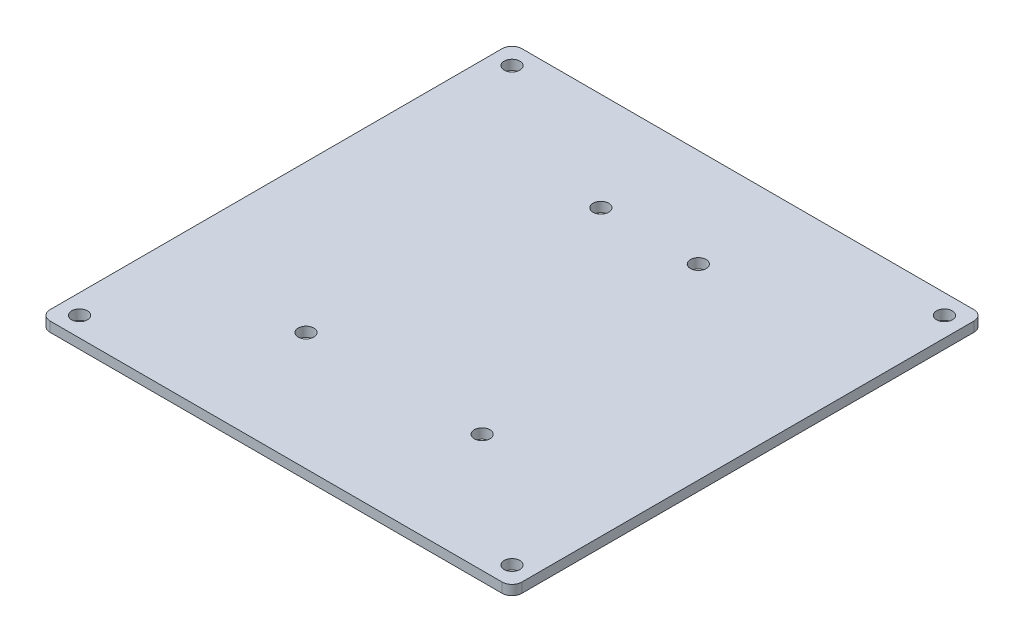
ISO-10303-21;
HEADER;
FILE_DESCRIPTION(('STEP AP214'),'2;1');
FILE_NAME('part.step','',(''),(''),'','','');
FILE_SCHEMA(('AUTOMOTIVE_DESIGN { 1 0 10303 214 1 1 1 1 }'));
ENDSEC;
DATA;
#1=APPLICATION_CONTEXT('core data for automotive mechanical design processes');
#2=APPLICATION_PROTOCOL_DEFINITION('international standard','automotive_design',2000,#1);
#3=PRODUCT_CONTEXT('',#1,'mechanical');
#4=PRODUCT('Part','Part','',(#3));
#5=PRODUCT_RELATED_PRODUCT_CATEGORY('part','',(#4));
#6=PRODUCT_DEFINITION_FORMATION('','',#4);
#7=PRODUCT_DEFINITION_CONTEXT('part definition',#1,'design');
#8=PRODUCT_DEFINITION('design','',#6,#7);
#9=PRODUCT_DEFINITION_SHAPE('','',#8);
#10=(LENGTH_UNIT() NAMED_UNIT(*) SI_UNIT(.MILLI.,.METRE.));
#11=(NAMED_UNIT(*) PLANE_ANGLE_UNIT() SI_UNIT($,.RADIAN.));
#12=(NAMED_UNIT(*) SI_UNIT($,.STERADIAN.) SOLID_ANGLE_UNIT());
#13=UNCERTAINTY_MEASURE_WITH_UNIT(LENGTH_MEASURE(1.E-05),#10,'distance_accuracy_value','');
#14=(GEOMETRIC_REPRESENTATION_CONTEXT(3) GLOBAL_UNCERTAINTY_ASSIGNED_CONTEXT((#13)) GLOBAL_UNIT_ASSIGNED_CONTEXT((#10,
#11,#12)) REPRESENTATION_CONTEXT('',''));
#15=CARTESIAN_POINT('',(0.,0.,0.));
#16=DIRECTION('',(0.,0.,1.));
#17=DIRECTION('',(1.,0.,0.));
#18=AXIS2_PLACEMENT_3D('',#15,#16,#17);
#19=CARTESIAN_POINT('',(0.,6.35,152.4));
#20=DIRECTION('',(0.,0.,-1.));
#21=DIRECTION('',(-1.,0.,0.));
#22=AXIS2_PLACEMENT_3D('',#19,#20,#21);
#23=PLANE('',#22);
#24=DIRECTION('',(1.,0.,0.));
#25=VECTOR('',#24,1.);
#26=CARTESIAN_POINT('',(0.,0.,152.4));
#27=LINE('',#26,#25);
#28=CARTESIAN_POINT('',(-146.05,0.,152.4));
#29=VERTEX_POINT('',#28);
#30=CARTESIAN_POINT('',(146.05,0.,152.4));
#31=VERTEX_POINT('',#30);
#32=EDGE_CURVE('E126',#29,#31,#27,.T.);
#33=ORIENTED_EDGE('',*,*,#32,.T.);
#34=DIRECTION('',(0.,-1.,0.));
#35=VECTOR('',#34,1.);
#36=CARTESIAN_POINT('',(146.05,6.35,152.4));
#37=LINE('',#36,#35);
#38=CARTESIAN_POINT('',(146.05,6.35,152.4));
#39=VERTEX_POINT('',#38);
#40=EDGE_CURVE('E183',#31,#39,#37,.F.);
#41=ORIENTED_EDGE('',*,*,#40,.T.);
#42=DIRECTION('',(1.,0.,0.));
#43=VECTOR('',#42,1.);
#44=CARTESIAN_POINT('',(0.,6.35,152.4));
#45=LINE('',#44,#43);
#46=CARTESIAN_POINT('',(-146.05,6.35,152.4));
#47=VERTEX_POINT('',#46);
#48=EDGE_CURVE('E129',#47,#39,#45,.T.);
#49=ORIENTED_EDGE('',*,*,#48,.F.);
#50=DIRECTION('',(0.,-1.,0.));
#51=VECTOR('',#50,1.);
#52=CARTESIAN_POINT('',(-146.05,0.,152.4));
#53=LINE('',#52,#51);
#54=EDGE_CURVE('E115',#47,#29,#53,.T.);
#55=ORIENTED_EDGE('',*,*,#54,.T.);
#56=EDGE_LOOP('',(#33,#41,#49,#55));
#57=FACE_BOUND('',#56,.T.);
#58=ADVANCED_FACE('F43',(#57),#23,.F.);
#59=CARTESIAN_POINT('',(152.4,6.35,0.));
#60=DIRECTION('',(-1.,0.,0.));
#61=DIRECTION('',(0.,0.,1.));
#62=AXIS2_PLACEMENT_3D('',#59,#60,#61);
#63=PLANE('',#62);
#64=DIRECTION('',(0.,0.,-1.));
#65=VECTOR('',#64,1.);
#66=CARTESIAN_POINT('',(152.4,6.35,0.));
#67=LINE('',#66,#65);
#68=CARTESIAN_POINT('',(152.4,6.35,146.05));
#69=VERTEX_POINT('',#68);
#70=CARTESIAN_POINT('',(152.4,6.35,-146.05));
#71=VERTEX_POINT('',#70);
#72=EDGE_CURVE('E313',#69,#71,#67,.T.);
#73=ORIENTED_EDGE('',*,*,#72,.F.);
#74=DIRECTION('',(0.,-1.,0.));
#75=VECTOR('',#74,1.);
#76=CARTESIAN_POINT('',(152.4,6.35,146.05));
#77=LINE('',#76,#75);
#78=CARTESIAN_POINT('',(152.4,0.,146.05));
#79=VERTEX_POINT('',#78);
#80=EDGE_CURVE('E171',#69,#79,#77,.T.);
#81=ORIENTED_EDGE('',*,*,#80,.T.);
#82=DIRECTION('',(0.,0.,-1.));
#83=VECTOR('',#82,1.);
#84=CARTESIAN_POINT('',(152.4,0.,0.));
#85=LINE('',#84,#83);
#86=CARTESIAN_POINT('',(152.4,0.,-146.05));
#87=VERTEX_POINT('',#86);
#88=EDGE_CURVE('E138',#79,#87,#85,.T.);
#89=ORIENTED_EDGE('',*,*,#88,.T.);
#90=DIRECTION('',(0.,-1.,0.));
#91=VECTOR('',#90,1.);
#92=CARTESIAN_POINT('',(152.4,6.35,-146.05));
#93=LINE('',#92,#91);
#94=EDGE_CURVE('E168',#87,#71,#93,.F.);
#95=ORIENTED_EDGE('',*,*,#94,.T.);
#96=EDGE_LOOP('',(#73,#81,#89,#95));
#97=FACE_BOUND('',#96,.T.);
#98=ADVANCED_FACE('F252',(#97),#63,.F.);
#99=CARTESIAN_POINT('',(0.,6.35,-152.4));
#100=DIRECTION('',(0.,0.,-1.));
#101=DIRECTION('',(-1.,0.,0.));
#102=AXIS2_PLACEMENT_3D('',#99,#100,#101);
#103=PLANE('',#102);
#104=DIRECTION('',(1.,0.,0.));
#105=VECTOR('',#104,1.);
#106=CARTESIAN_POINT('',(0.,6.35,-152.4));
#107=LINE('',#106,#105);
#108=CARTESIAN_POINT('',(-146.05,6.35,-152.4));
#109=VERTEX_POINT('',#108);
#110=CARTESIAN_POINT('',(146.05,6.35,-152.4));
#111=VERTEX_POINT('',#110);
#112=EDGE_CURVE('E202',#109,#111,#107,.T.);
#113=ORIENTED_EDGE('',*,*,#112,.T.);
#114=DIRECTION('',(0.,-1.,0.));
#115=VECTOR('',#114,1.);
#116=CARTESIAN_POINT('',(146.05,0.,-152.4));
#117=LINE('',#116,#115);
#118=CARTESIAN_POINT('',(146.05,0.,-152.4));
#119=VERTEX_POINT('',#118);
#120=EDGE_CURVE('E52',#111,#119,#117,.T.);
#121=ORIENTED_EDGE('',*,*,#120,.T.);
#122=DIRECTION('',(1.,0.,0.));
#123=VECTOR('',#122,1.);
#124=CARTESIAN_POINT('',(0.,0.,-152.4));
#125=LINE('',#124,#123);
#126=CARTESIAN_POINT('',(-146.05,0.,-152.4));
#127=VERTEX_POINT('',#126);
#128=EDGE_CURVE('E145',#127,#119,#125,.T.);
#129=ORIENTED_EDGE('',*,*,#128,.F.);
#130=DIRECTION('',(0.,-1.,0.));
#131=VECTOR('',#130,1.);
#132=CARTESIAN_POINT('',(-146.05,6.35,-152.4));
#133=LINE('',#132,#131);
#134=EDGE_CURVE('E66',#127,#109,#133,.F.);
#135=ORIENTED_EDGE('',*,*,#134,.T.);
#136=EDGE_LOOP('',(#113,#121,#129,#135));
#137=FACE_BOUND('',#136,.T.);
#138=ADVANCED_FACE('F257',(#137),#103,.T.);
#139=CARTESIAN_POINT('',(-152.4,6.35,0.));
#140=DIRECTION('',(-1.,0.,0.));
#141=DIRECTION('',(0.,0.,1.));
#142=AXIS2_PLACEMENT_3D('',#139,#140,#141);
#143=PLANE('',#142);
#144=DIRECTION('',(0.,0.,-1.));
#145=VECTOR('',#144,1.);
#146=CARTESIAN_POINT('',(-152.4,6.35,0.));
#147=LINE('',#146,#145);
#148=CARTESIAN_POINT('',(-152.4,6.35,146.05));
#149=VERTEX_POINT('',#148);
#150=CARTESIAN_POINT('',(-152.4,6.35,-146.05));
#151=VERTEX_POINT('',#150);
#152=EDGE_CURVE('E197',#149,#151,#147,.T.);
#153=ORIENTED_EDGE('',*,*,#152,.T.);
#154=DIRECTION('',(0.,-1.,0.));
#155=VECTOR('',#154,1.);
#156=CARTESIAN_POINT('',(-152.4,6.35,-146.05));
#157=LINE('',#156,#155);
#158=CARTESIAN_POINT('',(-152.4,0.,-146.05));
#159=VERTEX_POINT('',#158);
#160=EDGE_CURVE('E12',#151,#159,#157,.T.);
#161=ORIENTED_EDGE('',*,*,#160,.T.);
#162=DIRECTION('',(0.,0.,-1.));
#163=VECTOR('',#162,1.);
#164=CARTESIAN_POINT('',(-152.4,0.,0.));
#165=LINE('',#164,#163);
#166=CARTESIAN_POINT('',(-152.4,0.,146.05));
#167=VERTEX_POINT('',#166);
#168=EDGE_CURVE('E155',#167,#159,#165,.T.);
#169=ORIENTED_EDGE('',*,*,#168,.F.);
#170=DIRECTION('',(0.,-1.,0.));
#171=VECTOR('',#170,1.);
#172=CARTESIAN_POINT('',(-152.4,6.35,146.05));
#173=LINE('',#172,#171);
#174=EDGE_CURVE('E116',#167,#149,#173,.F.);
#175=ORIENTED_EDGE('',*,*,#174,.T.);
#176=EDGE_LOOP('',(#153,#161,#169,#175));
#177=FACE_BOUND('',#176,.T.);
#178=ADVANCED_FACE('F247',(#177),#143,.T.);
#179=CARTESIAN_POINT('',(56.896,6.35,76.2));
#180=DIRECTION('',(0.,-1.,0.));
#181=DIRECTION('',(0.,0.,-1.));
#182=AXIS2_PLACEMENT_3D('',#179,#180,#181);
#183=CYLINDRICAL_SURFACE('',#182,5.08000000000001);
#184=CARTESIAN_POINT('',(56.896,6.35,76.2));
#185=DIRECTION('',(0.,1.,0.));
#186=DIRECTION('',(0.,0.,1.));
#187=AXIS2_PLACEMENT_3D('',#184,#185,#186);
#188=CIRCLE('',#187,5.08000000000001);
#189=CARTESIAN_POINT('',(56.896,6.35,81.28));
#190=VERTEX_POINT('',#189);
#191=EDGE_CURVE('E303',#190,#190,#188,.T.);
#192=ORIENTED_EDGE('',*,*,#191,.T.);
#193=EDGE_LOOP('',(#192));
#194=FACE_BOUND('',#193,.T.);
#195=CARTESIAN_POINT('',(56.896,0.,76.2));
#196=DIRECTION('',(0.,1.,0.));
#197=DIRECTION('',(0.,0.,1.));
#198=AXIS2_PLACEMENT_3D('',#195,#196,#197);
#199=CIRCLE('',#198,5.08000000000001);
#200=CARTESIAN_POINT('',(56.896,0.,81.28));
#201=VERTEX_POINT('',#200);
#202=EDGE_CURVE('E139',#201,#201,#199,.T.);
#203=ORIENTED_EDGE('',*,*,#202,.F.);
#204=EDGE_LOOP('',(#203));
#205=FACE_BOUND('',#204,.T.);
#206=ADVANCED_FACE('F237',(#194,#205),#183,.F.);
#207=CARTESIAN_POINT('',(-56.896,6.35,76.2));
#208=DIRECTION('',(0.,-1.,0.));
#209=DIRECTION('',(0.,0.,-1.));
#210=AXIS2_PLACEMENT_3D('',#207,#208,#209);
#211=CYLINDRICAL_SURFACE('',#210,5.08000000000001);
#212=CARTESIAN_POINT('',(-56.896,6.35,76.2));
#213=DIRECTION('',(0.,1.,0.));
#214=DIRECTION('',(0.,0.,1.));
#215=AXIS2_PLACEMENT_3D('',#212,#213,#214);
#216=CIRCLE('',#215,5.08000000000001);
#217=CARTESIAN_POINT('',(-56.896,6.35,81.28));
#218=VERTEX_POINT('',#217);
#219=EDGE_CURVE('E300',#218,#218,#216,.T.);
#220=ORIENTED_EDGE('',*,*,#219,.T.);
#221=EDGE_LOOP('',(#220));
#222=FACE_BOUND('',#221,.T.);
#223=CARTESIAN_POINT('',(-56.896,0.,76.2));
#224=DIRECTION('',(0.,1.,0.));
#225=DIRECTION('',(0.,0.,1.));
#226=AXIS2_PLACEMENT_3D('',#223,#224,#225);
#227=CIRCLE('',#226,5.08000000000001);
#228=CARTESIAN_POINT('',(-56.896,0.,81.28));
#229=VERTEX_POINT('',#228);
#230=EDGE_CURVE('E148',#229,#229,#227,.T.);
#231=ORIENTED_EDGE('',*,*,#230,.F.);
#232=EDGE_LOOP('',(#231));
#233=FACE_BOUND('',#232,.T.);
#234=ADVANCED_FACE('F234',(#222,#233),#211,.F.);
#235=CARTESIAN_POINT('',(31.496,6.35,-88.9));
#236=DIRECTION('',(0.,-1.,0.));
#237=DIRECTION('',(0.,0.,-1.));
#238=AXIS2_PLACEMENT_3D('',#235,#236,#237);
#239=CYLINDRICAL_SURFACE('',#238,5.08);
#240=CARTESIAN_POINT('',(31.496,6.35,-88.9));
#241=DIRECTION('',(0.,1.,0.));
#242=DIRECTION('',(0.,0.,1.));
#243=AXIS2_PLACEMENT_3D('',#240,#241,#242);
#244=CIRCLE('',#243,5.08);
#245=CARTESIAN_POINT('',(31.496,6.35,-83.82));
#246=VERTEX_POINT('',#245);
#247=EDGE_CURVE('E297',#246,#246,#244,.T.);
#248=ORIENTED_EDGE('',*,*,#247,.T.);
#249=EDGE_LOOP('',(#248));
#250=FACE_BOUND('',#249,.T.);
#251=CARTESIAN_POINT('',(31.496,0.,-88.9));
#252=DIRECTION('',(0.,1.,0.));
#253=DIRECTION('',(0.,0.,1.));
#254=AXIS2_PLACEMENT_3D('',#251,#252,#253);
#255=CIRCLE('',#254,5.08);
#256=CARTESIAN_POINT('',(31.496,0.,-83.82));
#257=VERTEX_POINT('',#256);
#258=EDGE_CURVE('E224',#257,#257,#255,.T.);
#259=ORIENTED_EDGE('',*,*,#258,.F.);
#260=EDGE_LOOP('',(#259));
#261=FACE_BOUND('',#260,.T.);
#262=ADVANCED_FACE('F236',(#250,#261),#239,.F.);
#263=CARTESIAN_POINT('',(-31.496,6.35,-88.9));
#264=DIRECTION('',(0.,-1.,0.));
#265=DIRECTION('',(0.,0.,-1.));
#266=AXIS2_PLACEMENT_3D('',#263,#264,#265);
#267=CYLINDRICAL_SURFACE('',#266,5.08);
#268=CARTESIAN_POINT('',(-31.496,6.35,-88.9));
#269=DIRECTION('',(0.,1.,0.));
#270=DIRECTION('',(0.,0.,1.));
#271=AXIS2_PLACEMENT_3D('',#268,#269,#270);
#272=CIRCLE('',#271,5.08);
#273=CARTESIAN_POINT('',(-31.496,6.35,-83.82));
#274=VERTEX_POINT('',#273);
#275=EDGE_CURVE('E293',#274,#274,#272,.T.);
#276=ORIENTED_EDGE('',*,*,#275,.T.);
#277=EDGE_LOOP('',(#276));
#278=FACE_BOUND('',#277,.T.);
#279=CARTESIAN_POINT('',(-31.496,0.,-88.9));
#280=DIRECTION('',(0.,1.,0.));
#281=DIRECTION('',(0.,0.,1.));
#282=AXIS2_PLACEMENT_3D('',#279,#280,#281);
#283=CIRCLE('',#282,5.08);
#284=CARTESIAN_POINT('',(-31.496,0.,-83.82));
#285=VERTEX_POINT('',#284);
#286=EDGE_CURVE('E220',#285,#285,#283,.T.);
#287=ORIENTED_EDGE('',*,*,#286,.F.);
#288=EDGE_LOOP('',(#287));
#289=FACE_BOUND('',#288,.T.);
#290=ADVANCED_FACE('F244',(#278,#289),#267,.F.);
#291=CARTESIAN_POINT('',(139.7,6.35,-139.7));
#292=DIRECTION('',(0.,-1.,0.));
#293=DIRECTION('',(0.,0.,-1.));
#294=AXIS2_PLACEMENT_3D('',#291,#292,#293);
#295=CYLINDRICAL_SURFACE('',#294,5.07999999999999);
#296=CARTESIAN_POINT('',(139.7,6.35,-139.7));
#297=DIRECTION('',(0.,1.,0.));
#298=DIRECTION('',(0.,0.,1.));
#299=AXIS2_PLACEMENT_3D('',#296,#297,#298);
#300=CIRCLE('',#299,5.07999999999999);
#301=CARTESIAN_POINT('',(139.7,6.35,-134.62));
#302=VERTEX_POINT('',#301);
#303=EDGE_CURVE('E289',#302,#302,#300,.T.);
#304=ORIENTED_EDGE('',*,*,#303,.T.);
#305=EDGE_LOOP('',(#304));
#306=FACE_BOUND('',#305,.T.);
#307=CARTESIAN_POINT('',(139.7,0.,-139.7));
#308=DIRECTION('',(0.,1.,0.));
#309=DIRECTION('',(0.,0.,1.));
#310=AXIS2_PLACEMENT_3D('',#307,#308,#309);
#311=CIRCLE('',#310,5.07999999999999);
#312=CARTESIAN_POINT('',(139.7,0.,-134.62));
#313=VERTEX_POINT('',#312);
#314=EDGE_CURVE('E216',#313,#313,#311,.T.);
#315=ORIENTED_EDGE('',*,*,#314,.F.);
#316=EDGE_LOOP('',(#315));
#317=FACE_BOUND('',#316,.T.);
#318=ADVANCED_FACE('F410',(#306,#317),#295,.F.);
#319=CARTESIAN_POINT('',(-139.7,6.35,-139.7));
#320=DIRECTION('',(0.,-1.,0.));
#321=DIRECTION('',(0.,0.,-1.));
#322=AXIS2_PLACEMENT_3D('',#319,#320,#321);
#323=CYLINDRICAL_SURFACE('',#322,5.07999999999999);
#324=CARTESIAN_POINT('',(-139.7,6.35,-139.7));
#325=DIRECTION('',(0.,1.,0.));
#326=DIRECTION('',(0.,0.,1.));
#327=AXIS2_PLACEMENT_3D('',#324,#325,#326);
#328=CIRCLE('',#327,5.07999999999999);
#329=CARTESIAN_POINT('',(-139.7,6.35,-134.62));
#330=VERTEX_POINT('',#329);
#331=EDGE_CURVE('E285',#330,#330,#328,.F.);
#332=ORIENTED_EDGE('',*,*,#331,.F.);
#333=EDGE_LOOP('',(#332));
#334=FACE_BOUND('',#333,.T.);
#335=CARTESIAN_POINT('',(-139.7,0.,-139.7));
#336=DIRECTION('',(0.,1.,0.));
#337=DIRECTION('',(0.,0.,1.));
#338=AXIS2_PLACEMENT_3D('',#335,#336,#337);
#339=CIRCLE('',#338,5.07999999999999);
#340=CARTESIAN_POINT('',(-139.7,0.,-134.62));
#341=VERTEX_POINT('',#340);
#342=EDGE_CURVE('E212',#341,#341,#339,.F.);
#343=ORIENTED_EDGE('',*,*,#342,.T.);
#344=EDGE_LOOP('',(#343));
#345=FACE_BOUND('',#344,.T.);
#346=ADVANCED_FACE('F407',(#334,#345),#323,.F.);
#347=CARTESIAN_POINT('',(-139.7,6.35,139.7));
#348=DIRECTION('',(0.,-1.,0.));
#349=DIRECTION('',(0.,0.,-1.));
#350=AXIS2_PLACEMENT_3D('',#347,#348,#349);
#351=CYLINDRICAL_SURFACE('',#350,5.07999999999999);
#352=CARTESIAN_POINT('',(-139.7,6.35,139.7));
#353=DIRECTION('',(0.,1.,0.));
#354=DIRECTION('',(0.,0.,1.));
#355=AXIS2_PLACEMENT_3D('',#352,#353,#354);
#356=CIRCLE('',#355,5.07999999999999);
#357=CARTESIAN_POINT('',(-139.7,6.35,144.78));
#358=VERTEX_POINT('',#357);
#359=EDGE_CURVE('E161',#358,#358,#356,.T.);
#360=ORIENTED_EDGE('',*,*,#359,.T.);
#361=EDGE_LOOP('',(#360));
#362=FACE_BOUND('',#361,.T.);
#363=CARTESIAN_POINT('',(-139.7,0.,139.7));
#364=DIRECTION('',(0.,1.,0.));
#365=DIRECTION('',(0.,0.,1.));
#366=AXIS2_PLACEMENT_3D('',#363,#364,#365);
#367=CIRCLE('',#366,5.07999999999999);
#368=CARTESIAN_POINT('',(-139.7,0.,144.78));
#369=VERTEX_POINT('',#368);
#370=EDGE_CURVE('E208',#369,#369,#367,.T.);
#371=ORIENTED_EDGE('',*,*,#370,.F.);
#372=EDGE_LOOP('',(#371));
#373=FACE_BOUND('',#372,.T.);
#374=ADVANCED_FACE('F270',(#362,#373),#351,.F.);
#375=CARTESIAN_POINT('',(139.7,6.35,139.7));
#376=DIRECTION('',(0.,-1.,0.));
#377=DIRECTION('',(0.,0.,-1.));
#378=AXIS2_PLACEMENT_3D('',#375,#376,#377);
#379=CYLINDRICAL_SURFACE('',#378,5.07999999999999);
#380=CARTESIAN_POINT('',(139.7,6.35,139.7));
#381=DIRECTION('',(0.,1.,0.));
#382=DIRECTION('',(0.,0.,1.));
#383=AXIS2_PLACEMENT_3D('',#380,#381,#382);
#384=CIRCLE('',#383,5.07999999999999);
#385=CARTESIAN_POINT('',(139.7,6.35,144.78));
#386=VERTEX_POINT('',#385);
#387=EDGE_CURVE('E131',#386,#386,#384,.F.);
#388=ORIENTED_EDGE('',*,*,#387,.F.);
#389=EDGE_LOOP('',(#388));
#390=FACE_BOUND('',#389,.T.);
#391=CARTESIAN_POINT('',(139.7,0.,139.7));
#392=DIRECTION('',(0.,1.,0.));
#393=DIRECTION('',(0.,0.,1.));
#394=AXIS2_PLACEMENT_3D('',#391,#392,#393);
#395=CIRCLE('',#394,5.07999999999999);
#396=CARTESIAN_POINT('',(139.7,0.,144.78));
#397=VERTEX_POINT('',#396);
#398=EDGE_CURVE('E158',#397,#397,#395,.F.);
#399=ORIENTED_EDGE('',*,*,#398,.T.);
#400=EDGE_LOOP('',(#399));
#401=FACE_BOUND('',#400,.T.);
#402=ADVANCED_FACE('F266',(#390,#401),#379,.F.);
#403=CARTESIAN_POINT('',(0.,6.35,0.));
#404=DIRECTION('',(0.,1.,0.));
#405=DIRECTION('',(0.,0.,1.));
#406=AXIS2_PLACEMENT_3D('',#403,#404,#405);
#407=PLANE('',#406);
#408=ORIENTED_EDGE('',*,*,#359,.F.);
#409=EDGE_LOOP('',(#408));
#410=FACE_BOUND('',#409,.T.);
#411=ORIENTED_EDGE('',*,*,#331,.T.);
#412=EDGE_LOOP('',(#411));
#413=FACE_BOUND('',#412,.T.);
#414=ORIENTED_EDGE('',*,*,#303,.F.);
#415=EDGE_LOOP('',(#414));
#416=FACE_BOUND('',#415,.T.);
#417=ORIENTED_EDGE('',*,*,#275,.F.);
#418=EDGE_LOOP('',(#417));
#419=FACE_BOUND('',#418,.T.);
#420=ORIENTED_EDGE('',*,*,#247,.F.);
#421=EDGE_LOOP('',(#420));
#422=FACE_BOUND('',#421,.T.);
#423=ORIENTED_EDGE('',*,*,#219,.F.);
#424=EDGE_LOOP('',(#423));
#425=FACE_BOUND('',#424,.T.);
#426=ORIENTED_EDGE('',*,*,#191,.F.);
#427=EDGE_LOOP('',(#426));
#428=FACE_BOUND('',#427,.T.);
#429=ORIENTED_EDGE('',*,*,#48,.T.);
#430=CARTESIAN_POINT('',(146.05,6.35,146.05));
#431=DIRECTION('',(0.,1.,0.));
#432=DIRECTION('',(0.,0.,1.));
#433=AXIS2_PLACEMENT_3D('',#430,#431,#432);
#434=CIRCLE('',#433,6.35);
#435=EDGE_CURVE('E309',#39,#69,#434,.T.);
#436=ORIENTED_EDGE('',*,*,#435,.T.);
#437=ORIENTED_EDGE('',*,*,#72,.T.);
#438=CARTESIAN_POINT('',(146.05,6.35,-146.05));
#439=DIRECTION('',(0.,1.,0.));
#440=DIRECTION('',(0.,0.,1.));
#441=AXIS2_PLACEMENT_3D('',#438,#439,#440);
#442=CIRCLE('',#441,6.35);
#443=EDGE_CURVE('E59',#71,#111,#442,.T.);
#444=ORIENTED_EDGE('',*,*,#443,.T.);
#445=ORIENTED_EDGE('',*,*,#112,.F.);
#446=CARTESIAN_POINT('',(-146.05,6.35,-146.05));
#447=DIRECTION('',(0.,1.,0.));
#448=DIRECTION('',(0.,0.,1.));
#449=AXIS2_PLACEMENT_3D('',#446,#447,#448);
#450=CIRCLE('',#449,6.35);
#451=EDGE_CURVE('E186',#109,#151,#450,.T.);
#452=ORIENTED_EDGE('',*,*,#451,.T.);
#453=ORIENTED_EDGE('',*,*,#152,.F.);
#454=CARTESIAN_POINT('',(-146.05,6.35,146.05));
#455=DIRECTION('',(0.,1.,0.));
#456=DIRECTION('',(0.,0.,1.));
#457=AXIS2_PLACEMENT_3D('',#454,#455,#456);
#458=CIRCLE('',#457,6.35);
#459=EDGE_CURVE('E164',#149,#47,#458,.T.);
#460=ORIENTED_EDGE('',*,*,#459,.T.);
#461=EDGE_LOOP('',(#429,#436,#437,#444,#445,#452,#453,#460));
#462=FACE_BOUND('',#461,.T.);
#463=ORIENTED_EDGE('',*,*,#387,.T.);
#464=EDGE_LOOP('',(#463));
#465=FACE_BOUND('',#464,.T.);
#466=ADVANCED_FACE('F269',(#410,#413,#416,#419,#422,#425,#428,#462,#465),#407,.T.);
#467=CARTESIAN_POINT('',(0.,0.,0.));
#468=DIRECTION('',(0.,1.,0.));
#469=DIRECTION('',(0.,0.,1.));
#470=AXIS2_PLACEMENT_3D('',#467,#468,#469);
#471=PLANE('',#470);
#472=ORIENTED_EDGE('',*,*,#370,.T.);
#473=EDGE_LOOP('',(#472));
#474=FACE_BOUND('',#473,.T.);
#475=ORIENTED_EDGE('',*,*,#342,.F.);
#476=EDGE_LOOP('',(#475));
#477=FACE_BOUND('',#476,.T.);
#478=ORIENTED_EDGE('',*,*,#314,.T.);
#479=EDGE_LOOP('',(#478));
#480=FACE_BOUND('',#479,.T.);
#481=ORIENTED_EDGE('',*,*,#286,.T.);
#482=EDGE_LOOP('',(#481));
#483=FACE_BOUND('',#482,.T.);
#484=ORIENTED_EDGE('',*,*,#258,.T.);
#485=EDGE_LOOP('',(#484));
#486=FACE_BOUND('',#485,.T.);
#487=ORIENTED_EDGE('',*,*,#230,.T.);
#488=EDGE_LOOP('',(#487));
#489=FACE_BOUND('',#488,.T.);
#490=ORIENTED_EDGE('',*,*,#202,.T.);
#491=EDGE_LOOP('',(#490));
#492=FACE_BOUND('',#491,.T.);
#493=ORIENTED_EDGE('',*,*,#88,.F.);
#494=CARTESIAN_POINT('',(146.05,0.,146.05));
#495=DIRECTION('',(0.,1.,0.));
#496=DIRECTION('',(0.,0.,1.));
#497=AXIS2_PLACEMENT_3D('',#494,#495,#496);
#498=CIRCLE('',#497,6.35);
#499=EDGE_CURVE('E136',#79,#31,#498,.F.);
#500=ORIENTED_EDGE('',*,*,#499,.T.);
#501=ORIENTED_EDGE('',*,*,#32,.F.);
#502=CARTESIAN_POINT('',(-146.05,0.,146.05));
#503=DIRECTION('',(0.,1.,0.));
#504=DIRECTION('',(0.,0.,1.));
#505=AXIS2_PLACEMENT_3D('',#502,#503,#504);
#506=CIRCLE('',#505,6.35);
#507=EDGE_CURVE('E111',#29,#167,#506,.F.);
#508=ORIENTED_EDGE('',*,*,#507,.T.);
#509=ORIENTED_EDGE('',*,*,#168,.T.);
#510=CARTESIAN_POINT('',(-146.05,0.,-146.05));
#511=DIRECTION('',(0.,1.,0.));
#512=DIRECTION('',(0.,0.,1.));
#513=AXIS2_PLACEMENT_3D('',#510,#511,#512);
#514=CIRCLE('',#513,6.35);
#515=EDGE_CURVE('E175',#159,#127,#514,.F.);
#516=ORIENTED_EDGE('',*,*,#515,.T.);
#517=ORIENTED_EDGE('',*,*,#128,.T.);
#518=CARTESIAN_POINT('',(146.05,0.,-146.05));
#519=DIRECTION('',(0.,1.,0.));
#520=DIRECTION('',(0.,0.,1.));
#521=AXIS2_PLACEMENT_3D('',#518,#519,#520);
#522=CIRCLE('',#521,6.35);
#523=EDGE_CURVE('E178',#119,#87,#522,.F.);
#524=ORIENTED_EDGE('',*,*,#523,.T.);
#525=EDGE_LOOP('',(#493,#500,#501,#508,#509,#516,#517,#524));
#526=FACE_BOUND('',#525,.T.);
#527=ORIENTED_EDGE('',*,*,#398,.F.);
#528=EDGE_LOOP('',(#527));
#529=FACE_BOUND('',#528,.T.);
#530=ADVANCED_FACE('F134',(#474,#477,#480,#483,#486,#489,#492,#526,#529),#471,.F.);
#531=CARTESIAN_POINT('',(-146.05,6.35,146.05));
#532=DIRECTION('',(0.,1.,0.));
#533=DIRECTION('',(0.,0.,1.));
#534=AXIS2_PLACEMENT_3D('',#531,#532,#533);
#535=CYLINDRICAL_SURFACE('',#534,6.35);
#536=ORIENTED_EDGE('',*,*,#459,.F.);
#537=ORIENTED_EDGE('',*,*,#174,.F.);
#538=ORIENTED_EDGE('',*,*,#507,.F.);
#539=ORIENTED_EDGE('',*,*,#54,.F.);
#540=EDGE_LOOP('',(#536,#537,#538,#539));
#541=FACE_BOUND('',#540,.T.);
#542=ADVANCED_FACE('F114',(#541),#535,.T.);
#543=CARTESIAN_POINT('',(146.05,6.35,146.05));
#544=DIRECTION('',(0.,-1.,0.));
#545=DIRECTION('',(0.,0.,-1.));
#546=AXIS2_PLACEMENT_3D('',#543,#544,#545);
#547=CYLINDRICAL_SURFACE('',#546,6.35);
#548=ORIENTED_EDGE('',*,*,#435,.F.);
#549=ORIENTED_EDGE('',*,*,#40,.F.);
#550=ORIENTED_EDGE('',*,*,#499,.F.);
#551=ORIENTED_EDGE('',*,*,#80,.F.);
#552=EDGE_LOOP('',(#548,#549,#550,#551));
#553=FACE_BOUND('',#552,.T.);
#554=ADVANCED_FACE('F317',(#553),#547,.T.);
#555=CARTESIAN_POINT('',(146.05,6.35,-146.05));
#556=DIRECTION('',(0.,1.,0.));
#557=DIRECTION('',(0.,0.,1.));
#558=AXIS2_PLACEMENT_3D('',#555,#556,#557);
#559=CYLINDRICAL_SURFACE('',#558,6.35);
#560=ORIENTED_EDGE('',*,*,#443,.F.);
#561=ORIENTED_EDGE('',*,*,#94,.F.);
#562=ORIENTED_EDGE('',*,*,#523,.F.);
#563=ORIENTED_EDGE('',*,*,#120,.F.);
#564=EDGE_LOOP('',(#560,#561,#562,#563));
#565=FACE_BOUND('',#564,.T.);
#566=ADVANCED_FACE('F386',(#565),#559,.T.);
#567=CARTESIAN_POINT('',(-146.05,6.35,-146.05));
#568=DIRECTION('',(0.,-1.,0.));
#569=DIRECTION('',(0.,0.,-1.));
#570=AXIS2_PLACEMENT_3D('',#567,#568,#569);
#571=CYLINDRICAL_SURFACE('',#570,6.35);
#572=ORIENTED_EDGE('',*,*,#451,.F.);
#573=ORIENTED_EDGE('',*,*,#134,.F.);
#574=ORIENTED_EDGE('',*,*,#515,.F.);
#575=ORIENTED_EDGE('',*,*,#160,.F.);
#576=EDGE_LOOP('',(#572,#573,#574,#575));
#577=FACE_BOUND('',#576,.T.);
#578=ADVANCED_FACE('F45',(#577),#571,.T.);
#579=CLOSED_SHELL('',(#58,#98,#138,#178,#206,#234,#262,#290,#318,#346,#374,#402,#466,#530,#542,
#554,#566,#578));
#580=MANIFOLD_SOLID_BREP('B2',#579);
#581=ADVANCED_BREP_SHAPE_REPRESENTATION('',(#18,#580),#14);
#582=SHAPE_DEFINITION_REPRESENTATION(#9,#581);
ENDSEC;
END-ISO-10303-21;
